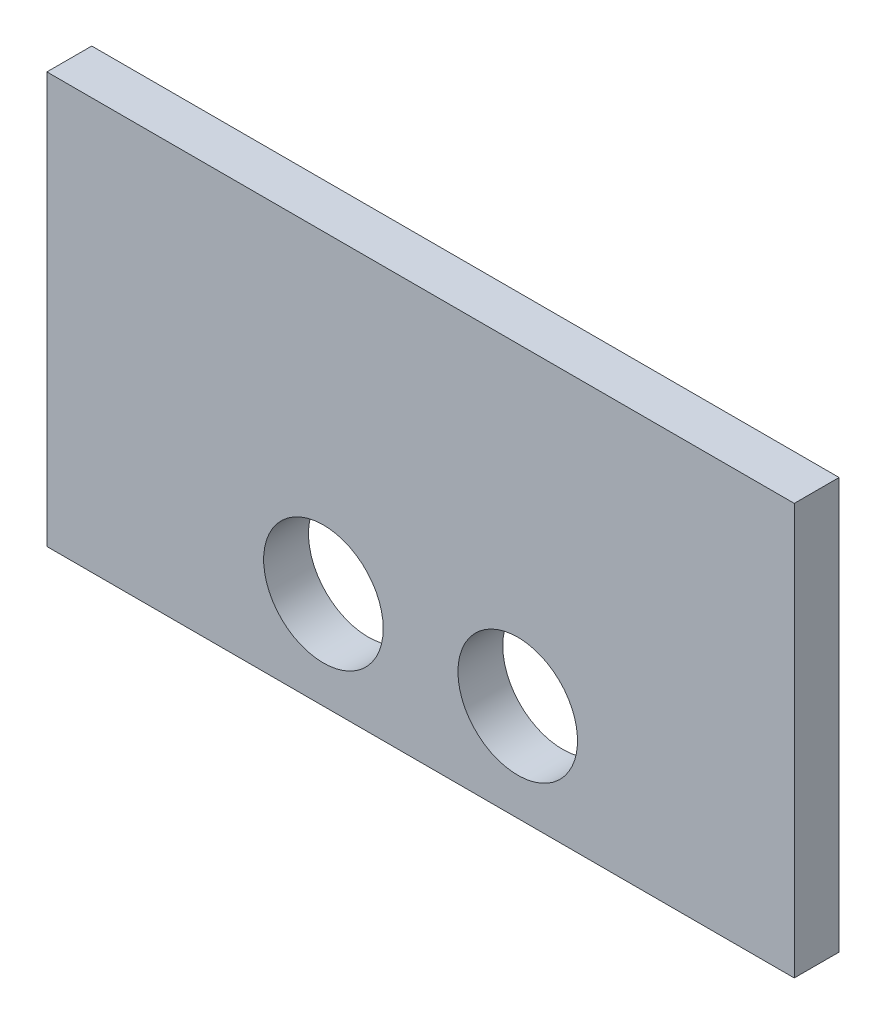
ISO-10303-21;
HEADER;
FILE_DESCRIPTION(('STEP AP214'),'2;1');
FILE_NAME('part.step','',(''),(''),'','','');
FILE_SCHEMA(('AUTOMOTIVE_DESIGN { 1 0 10303 214 1 1 1 1 }'));
ENDSEC;
DATA;
#1=APPLICATION_CONTEXT('core data for automotive mechanical design processes');
#2=APPLICATION_PROTOCOL_DEFINITION('international standard','automotive_design',2000,#1);
#3=PRODUCT_CONTEXT('',#1,'mechanical');
#4=PRODUCT('Part','Part','',(#3));
#5=PRODUCT_RELATED_PRODUCT_CATEGORY('part','',(#4));
#6=PRODUCT_DEFINITION_FORMATION('','',#4);
#7=PRODUCT_DEFINITION_CONTEXT('part definition',#1,'design');
#8=PRODUCT_DEFINITION('design','',#6,#7);
#9=PRODUCT_DEFINITION_SHAPE('','',#8);
#10=(LENGTH_UNIT() NAMED_UNIT(*) SI_UNIT(.MILLI.,.METRE.));
#11=(NAMED_UNIT(*) PLANE_ANGLE_UNIT() SI_UNIT($,.RADIAN.));
#12=(NAMED_UNIT(*) SI_UNIT($,.STERADIAN.) SOLID_ANGLE_UNIT());
#13=UNCERTAINTY_MEASURE_WITH_UNIT(LENGTH_MEASURE(1.E-05),#10,'distance_accuracy_value','');
#14=(GEOMETRIC_REPRESENTATION_CONTEXT(3) GLOBAL_UNCERTAINTY_ASSIGNED_CONTEXT((#13)) GLOBAL_UNIT_ASSIGNED_CONTEXT((#10,
#11,#12)) REPRESENTATION_CONTEXT('',''));
#15=CARTESIAN_POINT('',(0.,0.,0.));
#16=DIRECTION('',(0.,0.,1.));
#17=DIRECTION('',(1.,0.,0.));
#18=AXIS2_PLACEMENT_3D('',#15,#16,#17);
#19=CARTESIAN_POINT('',(-50.,46.4012198080189,6.));
#20=DIRECTION('',(1.,0.,0.));
#21=DIRECTION('',(0.,1.,0.));
#22=AXIS2_PLACEMENT_3D('',#19,#20,#21);
#23=PLANE('',#22);
#24=DIRECTION('',(0.,-1.,0.));
#25=VECTOR('',#24,1.);
#26=CARTESIAN_POINT('',(-50.,46.4012198080189,0.));
#27=LINE('',#26,#25);
#28=CARTESIAN_POINT('',(-50.,46.4012198080189,0.));
#29=VERTEX_POINT('',#28);
#30=CARTESIAN_POINT('',(-50.,-8.59878019198115,0.));
#31=VERTEX_POINT('',#30);
#32=EDGE_CURVE('E107',#29,#31,#27,.T.);
#33=ORIENTED_EDGE('',*,*,#32,.T.);
#34=DIRECTION('',(0.,0.,-1.));
#35=VECTOR('',#34,1.);
#36=CARTESIAN_POINT('',(-50.,-8.59878019198115,6.));
#37=LINE('',#36,#35);
#38=CARTESIAN_POINT('',(-50.,-8.59878019198115,6.));
#39=VERTEX_POINT('',#38);
#40=EDGE_CURVE('E11',#39,#31,#37,.T.);
#41=ORIENTED_EDGE('',*,*,#40,.F.);
#42=DIRECTION('',(0.,-1.,0.));
#43=VECTOR('',#42,1.);
#44=CARTESIAN_POINT('',(-50.,46.4012198080189,6.));
#45=LINE('',#44,#43);
#46=CARTESIAN_POINT('',(-50.,46.4012198080189,6.));
#47=VERTEX_POINT('',#46);
#48=EDGE_CURVE('E91',#47,#39,#45,.T.);
#49=ORIENTED_EDGE('',*,*,#48,.F.);
#50=DIRECTION('',(0.,0.,-1.));
#51=VECTOR('',#50,1.);
#52=CARTESIAN_POINT('',(-50.,46.4012198080189,6.));
#53=LINE('',#52,#51);
#54=EDGE_CURVE('E103',#47,#29,#53,.T.);
#55=ORIENTED_EDGE('',*,*,#54,.T.);
#56=EDGE_LOOP('',(#33,#41,#49,#55));
#57=FACE_BOUND('',#56,.T.);
#58=ADVANCED_FACE('F39',(#57),#23,.F.);
#59=CARTESIAN_POINT('',(-50.,-8.59878019198115,6.));
#60=DIRECTION('',(0.,1.,0.));
#61=DIRECTION('',(-1.,0.,0.));
#62=AXIS2_PLACEMENT_3D('',#59,#60,#61);
#63=PLANE('',#62);
#64=DIRECTION('',(1.,0.,0.));
#65=VECTOR('',#64,1.);
#66=CARTESIAN_POINT('',(-50.,-8.59878019198115,0.));
#67=LINE('',#66,#65);
#68=CARTESIAN_POINT('',(50.,-8.59878019198117,0.));
#69=VERTEX_POINT('',#68);
#70=EDGE_CURVE('E96',#31,#69,#67,.T.);
#71=ORIENTED_EDGE('',*,*,#70,.T.);
#72=DIRECTION('',(0.,0.,-1.));
#73=VECTOR('',#72,1.);
#74=CARTESIAN_POINT('',(50.,-8.59878019198117,6.));
#75=LINE('',#74,#73);
#76=CARTESIAN_POINT('',(50.,-8.59878019198117,6.));
#77=VERTEX_POINT('',#76);
#78=EDGE_CURVE('E48',#77,#69,#75,.T.);
#79=ORIENTED_EDGE('',*,*,#78,.F.);
#80=DIRECTION('',(1.,0.,0.));
#81=VECTOR('',#80,1.);
#82=CARTESIAN_POINT('',(-50.,-8.59878019198115,6.));
#83=LINE('',#82,#81);
#84=EDGE_CURVE('E86',#39,#77,#83,.T.);
#85=ORIENTED_EDGE('',*,*,#84,.F.);
#86=ORIENTED_EDGE('',*,*,#40,.T.);
#87=EDGE_LOOP('',(#71,#79,#85,#86));
#88=FACE_BOUND('',#87,.T.);
#89=ADVANCED_FACE('F95',(#88),#63,.F.);
#90=CARTESIAN_POINT('',(50.,46.4012198080188,6.));
#91=DIRECTION('',(-1.,0.,0.));
#92=DIRECTION('',(0.,-1.,0.));
#93=AXIS2_PLACEMENT_3D('',#90,#91,#92);
#94=PLANE('',#93);
#95=DIRECTION('',(0.,1.,0.));
#96=VECTOR('',#95,1.);
#97=CARTESIAN_POINT('',(50.,46.4012198080188,0.));
#98=LINE('',#97,#96);
#99=CARTESIAN_POINT('',(50.,46.4012198080188,0.));
#100=VERTEX_POINT('',#99);
#101=EDGE_CURVE('E73',#69,#100,#98,.T.);
#102=ORIENTED_EDGE('',*,*,#101,.T.);
#103=DIRECTION('',(0.,0.,-1.));
#104=VECTOR('',#103,1.);
#105=CARTESIAN_POINT('',(50.,46.4012198080188,6.));
#106=LINE('',#105,#104);
#107=CARTESIAN_POINT('',(50.,46.4012198080188,6.));
#108=VERTEX_POINT('',#107);
#109=EDGE_CURVE('E98',#108,#100,#106,.T.);
#110=ORIENTED_EDGE('',*,*,#109,.F.);
#111=DIRECTION('',(0.,1.,0.));
#112=VECTOR('',#111,1.);
#113=CARTESIAN_POINT('',(50.,46.4012198080188,6.));
#114=LINE('',#113,#112);
#115=EDGE_CURVE('E89',#77,#108,#114,.T.);
#116=ORIENTED_EDGE('',*,*,#115,.F.);
#117=ORIENTED_EDGE('',*,*,#78,.T.);
#118=EDGE_LOOP('',(#102,#110,#116,#117));
#119=FACE_BOUND('',#118,.T.);
#120=ADVANCED_FACE('F99',(#119),#94,.F.);
#121=CARTESIAN_POINT('',(50.,46.4012198080188,6.));
#122=DIRECTION('',(0.,-1.,0.));
#123=DIRECTION('',(1.,0.,0.));
#124=AXIS2_PLACEMENT_3D('',#121,#122,#123);
#125=PLANE('',#124);
#126=DIRECTION('',(-1.,0.,0.));
#127=VECTOR('',#126,1.);
#128=CARTESIAN_POINT('',(50.,46.4012198080188,0.));
#129=LINE('',#128,#127);
#130=EDGE_CURVE('E79',#100,#29,#129,.T.);
#131=ORIENTED_EDGE('',*,*,#130,.T.);
#132=ORIENTED_EDGE('',*,*,#54,.F.);
#133=DIRECTION('',(-1.,0.,0.));
#134=VECTOR('',#133,1.);
#135=CARTESIAN_POINT('',(50.,46.4012198080188,6.));
#136=LINE('',#135,#134);
#137=EDGE_CURVE('E56',#108,#47,#136,.T.);
#138=ORIENTED_EDGE('',*,*,#137,.F.);
#139=ORIENTED_EDGE('',*,*,#109,.T.);
#140=EDGE_LOOP('',(#131,#132,#138,#139));
#141=FACE_BOUND('',#140,.T.);
#142=ADVANCED_FACE('F121',(#141),#125,.F.);
#143=CARTESIAN_POINT('',(0.,0.,6.));
#144=DIRECTION('',(0.,0.,1.));
#145=DIRECTION('',(1.,0.,0.));
#146=AXIS2_PLACEMENT_3D('',#143,#144,#145);
#147=PLANE('',#146);
#148=CARTESIAN_POINT('',(-13.,4.40121980801885,6.));
#149=DIRECTION('',(0.,0.,1.));
#150=DIRECTION('',(1.,0.,0.));
#151=AXIS2_PLACEMENT_3D('',#148,#149,#150);
#152=CIRCLE('',#151,8.);
#153=CARTESIAN_POINT('',(-5.,4.40121980801885,6.));
#154=VERTEX_POINT('',#153);
#155=EDGE_CURVE('E136',#154,#154,#152,.T.);
#156=ORIENTED_EDGE('',*,*,#155,.F.);
#157=EDGE_LOOP('',(#156));
#158=FACE_BOUND('',#157,.T.);
#159=CARTESIAN_POINT('',(13.,4.40121980801885,6.));
#160=DIRECTION('',(0.,0.,1.));
#161=DIRECTION('',(-1.,0.,0.));
#162=AXIS2_PLACEMENT_3D('',#159,#160,#161);
#163=CIRCLE('',#162,8.);
#164=CARTESIAN_POINT('',(5.,4.40121980801885,6.));
#165=VERTEX_POINT('',#164);
#166=EDGE_CURVE('E128',#165,#165,#163,.T.);
#167=ORIENTED_EDGE('',*,*,#166,.F.);
#168=EDGE_LOOP('',(#167));
#169=FACE_BOUND('',#168,.T.);
#170=ORIENTED_EDGE('',*,*,#48,.T.);
#171=ORIENTED_EDGE('',*,*,#84,.T.);
#172=ORIENTED_EDGE('',*,*,#115,.T.);
#173=ORIENTED_EDGE('',*,*,#137,.T.);
#174=EDGE_LOOP('',(#170,#171,#172,#173));
#175=FACE_BOUND('',#174,.T.);
#176=ADVANCED_FACE('F87',(#158,#169,#175),#147,.T.);
#177=CARTESIAN_POINT('',(0.,0.,0.));
#178=DIRECTION('',(0.,0.,1.));
#179=DIRECTION('',(1.,0.,0.));
#180=AXIS2_PLACEMENT_3D('',#177,#178,#179);
#181=PLANE('',#180);
#182=CARTESIAN_POINT('',(-13.,4.40121980801885,0.));
#183=DIRECTION('',(0.,0.,1.));
#184=DIRECTION('',(1.,0.,0.));
#185=AXIS2_PLACEMENT_3D('',#182,#183,#184);
#186=CIRCLE('',#185,8.);
#187=CARTESIAN_POINT('',(-5.,4.40121980801885,0.));
#188=VERTEX_POINT('',#187);
#189=EDGE_CURVE('E111',#188,#188,#186,.T.);
#190=ORIENTED_EDGE('',*,*,#189,.T.);
#191=EDGE_LOOP('',(#190));
#192=FACE_BOUND('',#191,.T.);
#193=CARTESIAN_POINT('',(13.,4.40121980801885,0.));
#194=DIRECTION('',(0.,0.,1.));
#195=DIRECTION('',(-1.,0.,0.));
#196=AXIS2_PLACEMENT_3D('',#193,#194,#195);
#197=CIRCLE('',#196,8.);
#198=CARTESIAN_POINT('',(5.,4.40121980801885,0.));
#199=VERTEX_POINT('',#198);
#200=EDGE_CURVE('E132',#199,#199,#197,.T.);
#201=ORIENTED_EDGE('',*,*,#200,.T.);
#202=EDGE_LOOP('',(#201));
#203=FACE_BOUND('',#202,.T.);
#204=ORIENTED_EDGE('',*,*,#32,.F.);
#205=ORIENTED_EDGE('',*,*,#130,.F.);
#206=ORIENTED_EDGE('',*,*,#101,.F.);
#207=ORIENTED_EDGE('',*,*,#70,.F.);
#208=EDGE_LOOP('',(#204,#205,#206,#207));
#209=FACE_BOUND('',#208,.T.);
#210=ADVANCED_FACE('F124',(#192,#203,#209),#181,.F.);
#211=CARTESIAN_POINT('',(13.,4.40121980801885,0.));
#212=DIRECTION('',(0.,0.,1.));
#213=DIRECTION('',(1.,0.,0.));
#214=AXIS2_PLACEMENT_3D('',#211,#212,#213);
#215=CYLINDRICAL_SURFACE('',#214,8.);
#216=ORIENTED_EDGE('',*,*,#200,.F.);
#217=EDGE_LOOP('',(#216));
#218=FACE_BOUND('',#217,.T.);
#219=ORIENTED_EDGE('',*,*,#166,.T.);
#220=EDGE_LOOP('',(#219));
#221=FACE_BOUND('',#220,.T.);
#222=ADVANCED_FACE('F149',(#218,#221),#215,.F.);
#223=CARTESIAN_POINT('',(-13.,4.40121980801885,0.));
#224=DIRECTION('',(0.,0.,1.));
#225=DIRECTION('',(1.,0.,0.));
#226=AXIS2_PLACEMENT_3D('',#223,#224,#225);
#227=CYLINDRICAL_SURFACE('',#226,8.);
#228=ORIENTED_EDGE('',*,*,#189,.F.);
#229=EDGE_LOOP('',(#228));
#230=FACE_BOUND('',#229,.T.);
#231=ORIENTED_EDGE('',*,*,#155,.T.);
#232=EDGE_LOOP('',(#231));
#233=FACE_BOUND('',#232,.T.);
#234=ADVANCED_FACE('F146',(#230,#233),#227,.F.);
#235=CLOSED_SHELL('',(#58,#89,#120,#142,#176,#210,#222,#234));
#236=MANIFOLD_SOLID_BREP('B2',#235);
#237=ADVANCED_BREP_SHAPE_REPRESENTATION('',(#18,#236),#14);
#238=SHAPE_DEFINITION_REPRESENTATION(#9,#237);
ENDSEC;
END-ISO-10303-21;
